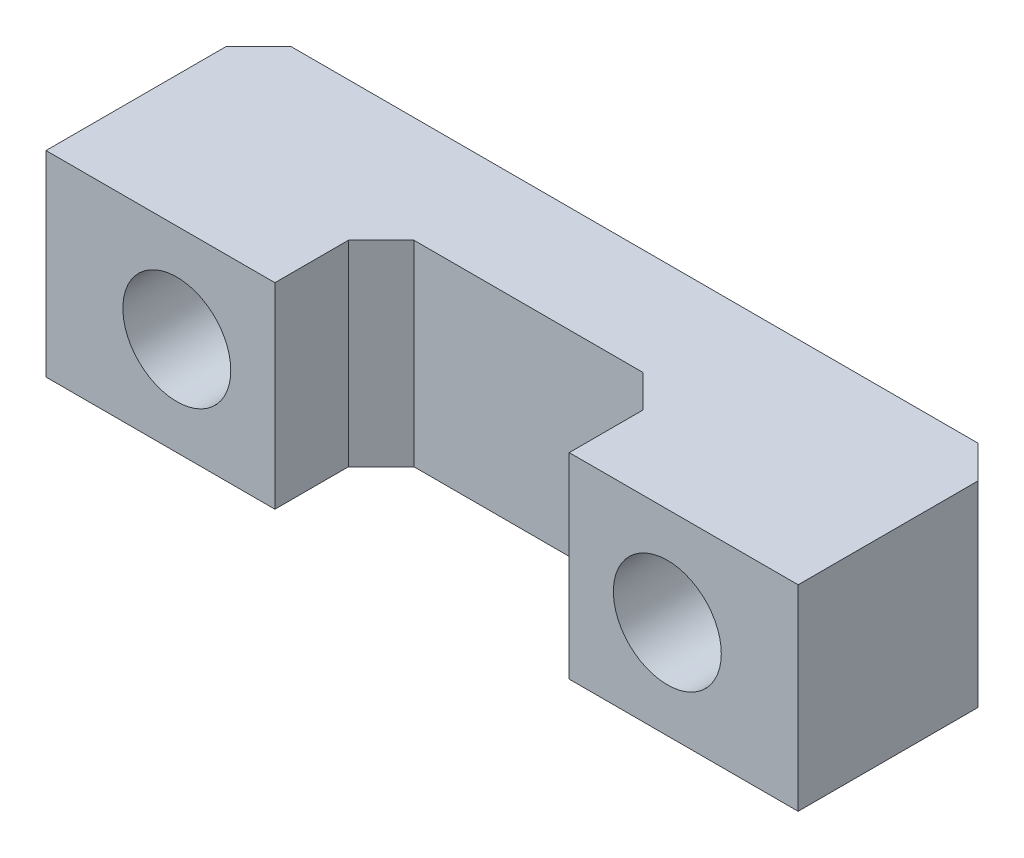
ISO-10303-21;
HEADER;
FILE_DESCRIPTION(('STEP AP214'),'2;1');
FILE_NAME('part.step','',(''),(''),'','','');
FILE_SCHEMA(('AUTOMOTIVE_DESIGN { 1 0 10303 214 1 1 1 1 }'));
ENDSEC;
DATA;
#1=APPLICATION_CONTEXT('core data for automotive mechanical design processes');
#2=APPLICATION_PROTOCOL_DEFINITION('international standard','automotive_design',2000,#1);
#3=PRODUCT_CONTEXT('',#1,'mechanical');
#4=PRODUCT('Part','Part','',(#3));
#5=PRODUCT_RELATED_PRODUCT_CATEGORY('part','',(#4));
#6=PRODUCT_DEFINITION_FORMATION('','',#4);
#7=PRODUCT_DEFINITION_CONTEXT('part definition',#1,'design');
#8=PRODUCT_DEFINITION('design','',#6,#7);
#9=PRODUCT_DEFINITION_SHAPE('','',#8);
#10=(LENGTH_UNIT() NAMED_UNIT(*) SI_UNIT(.MILLI.,.METRE.));
#11=(NAMED_UNIT(*) PLANE_ANGLE_UNIT() SI_UNIT($,.RADIAN.));
#12=(NAMED_UNIT(*) SI_UNIT($,.STERADIAN.) SOLID_ANGLE_UNIT());
#13=UNCERTAINTY_MEASURE_WITH_UNIT(LENGTH_MEASURE(1.E-05),#10,'distance_accuracy_value','');
#14=(GEOMETRIC_REPRESENTATION_CONTEXT(3) GLOBAL_UNCERTAINTY_ASSIGNED_CONTEXT((#13)) GLOBAL_UNIT_ASSIGNED_CONTEXT((#10,
#11,#12)) REPRESENTATION_CONTEXT('',''));
#15=CARTESIAN_POINT('',(0.,0.,0.));
#16=DIRECTION('',(0.,0.,1.));
#17=DIRECTION('',(1.,0.,0.));
#18=AXIS2_PLACEMENT_3D('',#15,#16,#17);
#19=CARTESIAN_POINT('',(4.5,6.,-0.5));
#20=DIRECTION('',(0.,0.,-1.));
#21=DIRECTION('',(-1.,0.,0.));
#22=AXIS2_PLACEMENT_3D('',#19,#20,#21);
#23=PLANE('',#22);
#24=CARTESIAN_POINT('',(7.5,3.,-0.5));
#25=DIRECTION('',(0.,0.,1.));
#26=DIRECTION('',(1.,0.,0.));
#27=AXIS2_PLACEMENT_3D('',#24,#25,#26);
#28=CIRCLE('',#27,1.65);
#29=CARTESIAN_POINT('',(9.15,3.,-0.5));
#30=VERTEX_POINT('',#29);
#31=EDGE_CURVE('E263',#30,#30,#28,.T.);
#32=ORIENTED_EDGE('',*,*,#31,.F.);
#33=EDGE_LOOP('',(#32));
#34=FACE_BOUND('',#33,.T.);
#35=DIRECTION('',(1.,0.,0.));
#36=VECTOR('',#35,1.);
#37=CARTESIAN_POINT('',(4.5,0.,-0.5));
#38=LINE('',#37,#36);
#39=CARTESIAN_POINT('',(4.5,0.,-0.5));
#40=VERTEX_POINT('',#39);
#41=CARTESIAN_POINT('',(11.5,0.,-0.5));
#42=VERTEX_POINT('',#41);
#43=EDGE_CURVE('E155',#40,#42,#38,.T.);
#44=ORIENTED_EDGE('',*,*,#43,.T.);
#45=DIRECTION('',(0.,-1.,0.));
#46=VECTOR('',#45,1.);
#47=CARTESIAN_POINT('',(11.5,6.,-0.5));
#48=LINE('',#47,#46);
#49=CARTESIAN_POINT('',(11.5,6.,-0.5));
#50=VERTEX_POINT('',#49);
#51=EDGE_CURVE('E11',#50,#42,#48,.T.);
#52=ORIENTED_EDGE('',*,*,#51,.F.);
#53=DIRECTION('',(1.,0.,0.));
#54=VECTOR('',#53,1.);
#55=CARTESIAN_POINT('',(4.5,6.,-0.5));
#56=LINE('',#55,#54);
#57=CARTESIAN_POINT('',(4.5,6.,-0.5));
#58=VERTEX_POINT('',#57);
#59=EDGE_CURVE('E177',#58,#50,#56,.T.);
#60=ORIENTED_EDGE('',*,*,#59,.F.);
#61=DIRECTION('',(0.,-1.,0.));
#62=VECTOR('',#61,1.);
#63=CARTESIAN_POINT('',(4.5,6.,-0.5));
#64=LINE('',#63,#62);
#65=EDGE_CURVE('E151',#58,#40,#64,.T.);
#66=ORIENTED_EDGE('',*,*,#65,.T.);
#67=EDGE_LOOP('',(#44,#52,#60,#66));
#68=FACE_BOUND('',#67,.T.);
#69=ADVANCED_FACE('F34',(#34,#68),#23,.F.);
#70=CARTESIAN_POINT('',(11.5,6.,-0.5));
#71=DIRECTION('',(-1.,0.,0.));
#72=DIRECTION('',(0.,0.,1.));
#73=AXIS2_PLACEMENT_3D('',#70,#71,#72);
#74=PLANE('',#73);
#75=DIRECTION('',(0.,0.,-1.));
#76=VECTOR('',#75,1.);
#77=CARTESIAN_POINT('',(11.5,0.,-0.5));
#78=LINE('',#77,#76);
#79=CARTESIAN_POINT('',(11.5,0.,-6.));
#80=VERTEX_POINT('',#79);
#81=EDGE_CURVE('E158',#42,#80,#78,.T.);
#82=ORIENTED_EDGE('',*,*,#81,.T.);
#83=DIRECTION('',(0.,-1.,0.));
#84=VECTOR('',#83,1.);
#85=CARTESIAN_POINT('',(11.5,6.,-6.));
#86=LINE('',#85,#84);
#87=CARTESIAN_POINT('',(11.5,6.,-6.));
#88=VERTEX_POINT('',#87);
#89=EDGE_CURVE('E43',#88,#80,#86,.T.);
#90=ORIENTED_EDGE('',*,*,#89,.F.);
#91=DIRECTION('',(0.,0.,-1.));
#92=VECTOR('',#91,1.);
#93=CARTESIAN_POINT('',(11.5,6.,-0.5));
#94=LINE('',#93,#92);
#95=EDGE_CURVE('E106',#50,#88,#94,.T.);
#96=ORIENTED_EDGE('',*,*,#95,.F.);
#97=ORIENTED_EDGE('',*,*,#51,.T.);
#98=EDGE_LOOP('',(#82,#90,#96,#97));
#99=FACE_BOUND('',#98,.T.);
#100=ADVANCED_FACE('F256',(#99),#74,.F.);
#101=CARTESIAN_POINT('',(11.5,6.,-6.));
#102=DIRECTION('',(-0.707106781186547,0.,0.707106781186548));
#103=DIRECTION('',(0.707106781186548,0.,0.707106781186547));
#104=AXIS2_PLACEMENT_3D('',#101,#102,#103);
#105=PLANE('',#104);
#106=DIRECTION('',(-0.707106781186548,0.,-0.707106781186547));
#107=VECTOR('',#106,1.);
#108=CARTESIAN_POINT('',(11.5,0.,-6.));
#109=LINE('',#108,#107);
#110=CARTESIAN_POINT('',(10.5,0.,-7.));
#111=VERTEX_POINT('',#110);
#112=EDGE_CURVE('E160',#80,#111,#109,.T.);
#113=ORIENTED_EDGE('',*,*,#112,.T.);
#114=DIRECTION('',(0.,-1.,0.));
#115=VECTOR('',#114,1.);
#116=CARTESIAN_POINT('',(10.5,6.,-7.));
#117=LINE('',#116,#115);
#118=CARTESIAN_POINT('',(10.5,6.,-7.));
#119=VERTEX_POINT('',#118);
#120=EDGE_CURVE('E196',#119,#111,#117,.T.);
#121=ORIENTED_EDGE('',*,*,#120,.F.);
#122=DIRECTION('',(-0.707106781186548,0.,-0.707106781186547));
#123=VECTOR('',#122,1.);
#124=CARTESIAN_POINT('',(11.5,6.,-6.));
#125=LINE('',#124,#123);
#126=EDGE_CURVE('E205',#88,#119,#125,.T.);
#127=ORIENTED_EDGE('',*,*,#126,.F.);
#128=ORIENTED_EDGE('',*,*,#89,.T.);
#129=EDGE_LOOP('',(#113,#121,#127,#128));
#130=FACE_BOUND('',#129,.T.);
#131=ADVANCED_FACE('F203',(#130),#105,.F.);
#132=CARTESIAN_POINT('',(10.5,6.,-7.));
#133=DIRECTION('',(0.,0.,1.));
#134=DIRECTION('',(1.,0.,0.));
#135=AXIS2_PLACEMENT_3D('',#132,#133,#134);
#136=PLANE('',#135);
#137=CARTESIAN_POINT('',(-7.5,3.,-7.));
#138=DIRECTION('',(0.,0.,1.));
#139=DIRECTION('',(1.,0.,0.));
#140=AXIS2_PLACEMENT_3D('',#137,#138,#139);
#141=CIRCLE('',#140,1.65);
#142=CARTESIAN_POINT('',(-5.85,3.,-7.));
#143=VERTEX_POINT('',#142);
#144=EDGE_CURVE('E268',#143,#143,#141,.T.);
#145=ORIENTED_EDGE('',*,*,#144,.T.);
#146=EDGE_LOOP('',(#145));
#147=FACE_BOUND('',#146,.T.);
#148=CARTESIAN_POINT('',(7.5,3.,-7.));
#149=DIRECTION('',(0.,0.,1.));
#150=DIRECTION('',(1.,0.,0.));
#151=AXIS2_PLACEMENT_3D('',#148,#149,#150);
#152=CIRCLE('',#151,1.65);
#153=CARTESIAN_POINT('',(9.15,3.,-7.));
#154=VERTEX_POINT('',#153);
#155=EDGE_CURVE('E37',#154,#154,#152,.T.);
#156=ORIENTED_EDGE('',*,*,#155,.T.);
#157=EDGE_LOOP('',(#156));
#158=FACE_BOUND('',#157,.T.);
#159=DIRECTION('',(-1.,0.,0.));
#160=VECTOR('',#159,1.);
#161=CARTESIAN_POINT('',(10.5,0.,-7.));
#162=LINE('',#161,#160);
#163=CARTESIAN_POINT('',(-10.5,0.,-7.));
#164=VERTEX_POINT('',#163);
#165=EDGE_CURVE('E162',#111,#164,#162,.T.);
#166=ORIENTED_EDGE('',*,*,#165,.T.);
#167=DIRECTION('',(0.,-1.,0.));
#168=VECTOR('',#167,1.);
#169=CARTESIAN_POINT('',(-10.5,6.,-7.));
#170=LINE('',#169,#168);
#171=CARTESIAN_POINT('',(-10.5,6.,-7.));
#172=VERTEX_POINT('',#171);
#173=EDGE_CURVE('E193',#172,#164,#170,.T.);
#174=ORIENTED_EDGE('',*,*,#173,.F.);
#175=DIRECTION('',(-1.,0.,0.));
#176=VECTOR('',#175,1.);
#177=CARTESIAN_POINT('',(10.5,6.,-7.));
#178=LINE('',#177,#176);
#179=EDGE_CURVE('E223',#119,#172,#178,.T.);
#180=ORIENTED_EDGE('',*,*,#179,.F.);
#181=ORIENTED_EDGE('',*,*,#120,.T.);
#182=EDGE_LOOP('',(#166,#174,#180,#181));
#183=FACE_BOUND('',#182,.T.);
#184=ADVANCED_FACE('F214',(#147,#158,#183),#136,.F.);
#185=CARTESIAN_POINT('',(-11.5,6.,-6.));
#186=DIRECTION('',(0.707106781186547,0.,0.707106781186548));
#187=DIRECTION('',(0.707106781186548,0.,-0.707106781186547));
#188=AXIS2_PLACEMENT_3D('',#185,#186,#187);
#189=PLANE('',#188);
#190=DIRECTION('',(-0.707106781186548,0.,0.707106781186547));
#191=VECTOR('',#190,1.);
#192=CARTESIAN_POINT('',(-11.5,0.,-6.));
#193=LINE('',#192,#191);
#194=CARTESIAN_POINT('',(-11.5,0.,-6.));
#195=VERTEX_POINT('',#194);
#196=EDGE_CURVE('E164',#164,#195,#193,.T.);
#197=ORIENTED_EDGE('',*,*,#196,.T.);
#198=DIRECTION('',(0.,-1.,0.));
#199=VECTOR('',#198,1.);
#200=CARTESIAN_POINT('',(-11.5,6.,-6.));
#201=LINE('',#200,#199);
#202=CARTESIAN_POINT('',(-11.5,6.,-6.));
#203=VERTEX_POINT('',#202);
#204=EDGE_CURVE('E190',#203,#195,#201,.T.);
#205=ORIENTED_EDGE('',*,*,#204,.F.);
#206=DIRECTION('',(-0.707106781186548,0.,0.707106781186547));
#207=VECTOR('',#206,1.);
#208=CARTESIAN_POINT('',(-11.5,6.,-6.));
#209=LINE('',#208,#207);
#210=EDGE_CURVE('E220',#172,#203,#209,.T.);
#211=ORIENTED_EDGE('',*,*,#210,.F.);
#212=ORIENTED_EDGE('',*,*,#173,.T.);
#213=EDGE_LOOP('',(#197,#205,#211,#212));
#214=FACE_BOUND('',#213,.T.);
#215=ADVANCED_FACE('F218',(#214),#189,.F.);
#216=CARTESIAN_POINT('',(-11.5,6.,-0.5));
#217=DIRECTION('',(1.,0.,0.));
#218=DIRECTION('',(0.,0.,-1.));
#219=AXIS2_PLACEMENT_3D('',#216,#217,#218);
#220=PLANE('',#219);
#221=DIRECTION('',(0.,0.,1.));
#222=VECTOR('',#221,1.);
#223=CARTESIAN_POINT('',(-11.5,0.,-0.5));
#224=LINE('',#223,#222);
#225=CARTESIAN_POINT('',(-11.5,0.,-0.5));
#226=VERTEX_POINT('',#225);
#227=EDGE_CURVE('E166',#195,#226,#224,.T.);
#228=ORIENTED_EDGE('',*,*,#227,.T.);
#229=DIRECTION('',(0.,-1.,0.));
#230=VECTOR('',#229,1.);
#231=CARTESIAN_POINT('',(-11.5,6.,-0.5));
#232=LINE('',#231,#230);
#233=CARTESIAN_POINT('',(-11.5,6.,-0.5));
#234=VERTEX_POINT('',#233);
#235=EDGE_CURVE('E187',#234,#226,#232,.T.);
#236=ORIENTED_EDGE('',*,*,#235,.F.);
#237=DIRECTION('',(0.,0.,1.));
#238=VECTOR('',#237,1.);
#239=CARTESIAN_POINT('',(-11.5,6.,-0.5));
#240=LINE('',#239,#238);
#241=EDGE_CURVE('E222',#203,#234,#240,.T.);
#242=ORIENTED_EDGE('',*,*,#241,.F.);
#243=ORIENTED_EDGE('',*,*,#204,.T.);
#244=EDGE_LOOP('',(#228,#236,#242,#243));
#245=FACE_BOUND('',#244,.T.);
#246=ADVANCED_FACE('F312',(#245),#220,.F.);
#247=CARTESIAN_POINT('',(-11.5,6.,-0.5));
#248=DIRECTION('',(0.,0.,-1.));
#249=DIRECTION('',(-1.,0.,0.));
#250=AXIS2_PLACEMENT_3D('',#247,#248,#249);
#251=PLANE('',#250);
#252=CARTESIAN_POINT('',(-7.5,3.,-0.5));
#253=DIRECTION('',(0.,0.,1.));
#254=DIRECTION('',(1.,0.,0.));
#255=AXIS2_PLACEMENT_3D('',#252,#253,#254);
#256=CIRCLE('',#255,1.65);
#257=CARTESIAN_POINT('',(-5.85,3.,-0.5));
#258=VERTEX_POINT('',#257);
#259=EDGE_CURVE('E265',#258,#258,#256,.T.);
#260=ORIENTED_EDGE('',*,*,#259,.F.);
#261=EDGE_LOOP('',(#260));
#262=FACE_BOUND('',#261,.T.);
#263=DIRECTION('',(1.,0.,0.));
#264=VECTOR('',#263,1.);
#265=CARTESIAN_POINT('',(-11.5,0.,-0.5));
#266=LINE('',#265,#264);
#267=CARTESIAN_POINT('',(-4.5,0.,-0.5));
#268=VERTEX_POINT('',#267);
#269=EDGE_CURVE('E168',#226,#268,#266,.T.);
#270=ORIENTED_EDGE('',*,*,#269,.T.);
#271=DIRECTION('',(0.,-1.,0.));
#272=VECTOR('',#271,1.);
#273=CARTESIAN_POINT('',(-4.5,6.,-0.5));
#274=LINE('',#273,#272);
#275=CARTESIAN_POINT('',(-4.5,6.,-0.5));
#276=VERTEX_POINT('',#275);
#277=EDGE_CURVE('E184',#276,#268,#274,.T.);
#278=ORIENTED_EDGE('',*,*,#277,.F.);
#279=DIRECTION('',(1.,0.,0.));
#280=VECTOR('',#279,1.);
#281=CARTESIAN_POINT('',(-11.5,6.,-0.5));
#282=LINE('',#281,#280);
#283=EDGE_CURVE('E225',#234,#276,#282,.T.);
#284=ORIENTED_EDGE('',*,*,#283,.F.);
#285=ORIENTED_EDGE('',*,*,#235,.T.);
#286=EDGE_LOOP('',(#270,#278,#284,#285));
#287=FACE_BOUND('',#286,.T.);
#288=ADVANCED_FACE('F304',(#262,#287),#251,.F.);
#289=CARTESIAN_POINT('',(-4.5,6.,-2.75));
#290=DIRECTION('',(-1.,0.,0.));
#291=DIRECTION('',(0.,0.,1.));
#292=AXIS2_PLACEMENT_3D('',#289,#290,#291);
#293=PLANE('',#292);
#294=DIRECTION('',(0.,0.,-1.));
#295=VECTOR('',#294,1.);
#296=CARTESIAN_POINT('',(-4.5,0.,-2.75));
#297=LINE('',#296,#295);
#298=CARTESIAN_POINT('',(-4.5,0.,-2.75));
#299=VERTEX_POINT('',#298);
#300=EDGE_CURVE('E170',#268,#299,#297,.T.);
#301=ORIENTED_EDGE('',*,*,#300,.T.);
#302=DIRECTION('',(0.,-1.,0.));
#303=VECTOR('',#302,1.);
#304=CARTESIAN_POINT('',(-4.5,6.,-2.75));
#305=LINE('',#304,#303);
#306=CARTESIAN_POINT('',(-4.5,6.,-2.75));
#307=VERTEX_POINT('',#306);
#308=EDGE_CURVE('E181',#307,#299,#305,.T.);
#309=ORIENTED_EDGE('',*,*,#308,.F.);
#310=DIRECTION('',(0.,0.,-1.));
#311=VECTOR('',#310,1.);
#312=CARTESIAN_POINT('',(-4.5,6.,-2.75));
#313=LINE('',#312,#311);
#314=EDGE_CURVE('E231',#276,#307,#313,.T.);
#315=ORIENTED_EDGE('',*,*,#314,.F.);
#316=ORIENTED_EDGE('',*,*,#277,.T.);
#317=EDGE_LOOP('',(#301,#309,#315,#316));
#318=FACE_BOUND('',#317,.T.);
#319=ADVANCED_FACE('F237',(#318),#293,.F.);
#320=CARTESIAN_POINT('',(-3.49999999999999,6.,-3.75000000000001));
#321=DIRECTION('',(-0.707106781186548,0.,-0.707106781186548));
#322=DIRECTION('',(-0.707106781186548,0.,0.707106781186548));
#323=AXIS2_PLACEMENT_3D('',#320,#321,#322);
#324=PLANE('',#323);
#325=DIRECTION('',(0.707106781186547,0.,-0.707106781186547));
#326=VECTOR('',#325,1.);
#327=CARTESIAN_POINT('',(-3.49999999999999,0.,-3.75000000000001));
#328=LINE('',#327,#326);
#329=CARTESIAN_POINT('',(-3.49999999999999,0.,-3.75000000000001));
#330=VERTEX_POINT('',#329);
#331=EDGE_CURVE('E172',#299,#330,#328,.T.);
#332=ORIENTED_EDGE('',*,*,#331,.T.);
#333=DIRECTION('',(0.,-1.,0.));
#334=VECTOR('',#333,1.);
#335=CARTESIAN_POINT('',(-3.49999999999999,6.,-3.75000000000001));
#336=LINE('',#335,#334);
#337=CARTESIAN_POINT('',(-3.49999999999999,6.,-3.75000000000001));
#338=VERTEX_POINT('',#337);
#339=EDGE_CURVE('E146',#338,#330,#336,.T.);
#340=ORIENTED_EDGE('',*,*,#339,.F.);
#341=DIRECTION('',(0.707106781186547,0.,-0.707106781186547));
#342=VECTOR('',#341,1.);
#343=CARTESIAN_POINT('',(-3.49999999999999,6.,-3.75000000000001));
#344=LINE('',#343,#342);
#345=EDGE_CURVE('E137',#307,#338,#344,.T.);
#346=ORIENTED_EDGE('',*,*,#345,.F.);
#347=ORIENTED_EDGE('',*,*,#308,.T.);
#348=EDGE_LOOP('',(#332,#340,#346,#347));
#349=FACE_BOUND('',#348,.T.);
#350=ADVANCED_FACE('F241',(#349),#324,.F.);
#351=CARTESIAN_POINT('',(3.49999999999999,6.,-3.75000000000001));
#352=DIRECTION('',(0.,0.,-1.));
#353=DIRECTION('',(-1.,0.,0.));
#354=AXIS2_PLACEMENT_3D('',#351,#352,#353);
#355=PLANE('',#354);
#356=DIRECTION('',(1.,0.,0.));
#357=VECTOR('',#356,1.);
#358=CARTESIAN_POINT('',(3.49999999999999,0.,-3.75000000000001));
#359=LINE('',#358,#357);
#360=CARTESIAN_POINT('',(3.49999999999999,0.,-3.75000000000001));
#361=VERTEX_POINT('',#360);
#362=EDGE_CURVE('E145',#330,#361,#359,.T.);
#363=ORIENTED_EDGE('',*,*,#362,.T.);
#364=DIRECTION('',(0.,-1.,0.));
#365=VECTOR('',#364,1.);
#366=CARTESIAN_POINT('',(3.49999999999999,6.,-3.75000000000001));
#367=LINE('',#366,#365);
#368=CARTESIAN_POINT('',(3.49999999999999,6.,-3.75000000000001));
#369=VERTEX_POINT('',#368);
#370=EDGE_CURVE('E142',#369,#361,#367,.T.);
#371=ORIENTED_EDGE('',*,*,#370,.F.);
#372=DIRECTION('',(1.,0.,0.));
#373=VECTOR('',#372,1.);
#374=CARTESIAN_POINT('',(3.49999999999999,6.,-3.75000000000001));
#375=LINE('',#374,#373);
#376=EDGE_CURVE('E131',#338,#369,#375,.T.);
#377=ORIENTED_EDGE('',*,*,#376,.F.);
#378=ORIENTED_EDGE('',*,*,#339,.T.);
#379=EDGE_LOOP('',(#363,#371,#377,#378));
#380=FACE_BOUND('',#379,.T.);
#381=ADVANCED_FACE('F143',(#380),#355,.F.);
#382=CARTESIAN_POINT('',(3.49999999999999,6.,-3.75000000000001));
#383=DIRECTION('',(0.707106781186547,0.,-0.707106781186548));
#384=DIRECTION('',(-0.707106781186548,0.,-0.707106781186547));
#385=AXIS2_PLACEMENT_3D('',#382,#383,#384);
#386=PLANE('',#385);
#387=DIRECTION('',(0.707106781186548,0.,0.707106781186547));
#388=VECTOR('',#387,1.);
#389=CARTESIAN_POINT('',(3.49999999999999,0.,-3.75000000000001));
#390=LINE('',#389,#388);
#391=CARTESIAN_POINT('',(4.49999999999999,0.,-2.75000000000002));
#392=VERTEX_POINT('',#391);
#393=EDGE_CURVE('E92',#361,#392,#390,.T.);
#394=ORIENTED_EDGE('',*,*,#393,.T.);
#395=DIRECTION('',(0.,-1.,0.));
#396=VECTOR('',#395,1.);
#397=CARTESIAN_POINT('',(4.49999999999999,6.,-2.75000000000002));
#398=LINE('',#397,#396);
#399=CARTESIAN_POINT('',(4.49999999999999,6.,-2.75000000000002));
#400=VERTEX_POINT('',#399);
#401=EDGE_CURVE('E147',#400,#392,#398,.T.);
#402=ORIENTED_EDGE('',*,*,#401,.F.);
#403=DIRECTION('',(0.707106781186548,0.,0.707106781186547));
#404=VECTOR('',#403,1.);
#405=CARTESIAN_POINT('',(3.49999999999999,6.,-3.75000000000001));
#406=LINE('',#405,#404);
#407=EDGE_CURVE('E135',#369,#400,#406,.T.);
#408=ORIENTED_EDGE('',*,*,#407,.F.);
#409=ORIENTED_EDGE('',*,*,#370,.T.);
#410=EDGE_LOOP('',(#394,#402,#408,#409));
#411=FACE_BOUND('',#410,.T.);
#412=ADVANCED_FACE('F149',(#411),#386,.F.);
#413=CARTESIAN_POINT('',(4.5,6.,-0.5));
#414=DIRECTION('',(1.,0.,0.));
#415=DIRECTION('',(0.,0.,-1.));
#416=AXIS2_PLACEMENT_3D('',#413,#414,#415);
#417=PLANE('',#416);
#418=DIRECTION('',(0.,0.,1.));
#419=VECTOR('',#418,1.);
#420=CARTESIAN_POINT('',(4.5,0.,-0.5));
#421=LINE('',#420,#419);
#422=EDGE_CURVE('E98',#392,#40,#421,.T.);
#423=ORIENTED_EDGE('',*,*,#422,.T.);
#424=ORIENTED_EDGE('',*,*,#65,.F.);
#425=DIRECTION('',(0.,0.,1.));
#426=VECTOR('',#425,1.);
#427=CARTESIAN_POINT('',(4.5,6.,-0.5));
#428=LINE('',#427,#426);
#429=EDGE_CURVE('E51',#400,#58,#428,.T.);
#430=ORIENTED_EDGE('',*,*,#429,.F.);
#431=ORIENTED_EDGE('',*,*,#401,.T.);
#432=EDGE_LOOP('',(#423,#424,#430,#431));
#433=FACE_BOUND('',#432,.T.);
#434=ADVANCED_FACE('F245',(#433),#417,.F.);
#435=CARTESIAN_POINT('',(0.,6.,0.));
#436=DIRECTION('',(0.,1.,0.));
#437=DIRECTION('',(0.,0.,1.));
#438=AXIS2_PLACEMENT_3D('',#435,#436,#437);
#439=PLANE('',#438);
#440=ORIENTED_EDGE('',*,*,#59,.T.);
#441=ORIENTED_EDGE('',*,*,#95,.T.);
#442=ORIENTED_EDGE('',*,*,#126,.T.);
#443=ORIENTED_EDGE('',*,*,#179,.T.);
#444=ORIENTED_EDGE('',*,*,#210,.T.);
#445=ORIENTED_EDGE('',*,*,#241,.T.);
#446=ORIENTED_EDGE('',*,*,#283,.T.);
#447=ORIENTED_EDGE('',*,*,#314,.T.);
#448=ORIENTED_EDGE('',*,*,#345,.T.);
#449=ORIENTED_EDGE('',*,*,#376,.T.);
#450=ORIENTED_EDGE('',*,*,#407,.T.);
#451=ORIENTED_EDGE('',*,*,#429,.T.);
#452=EDGE_LOOP('',(#440,#441,#442,#443,#444,#445,#446,#447,#448,#449,#450,#451));
#453=FACE_BOUND('',#452,.T.);
#454=ADVANCED_FACE('F133',(#453),#439,.T.);
#455=CARTESIAN_POINT('',(0.,0.,0.));
#456=DIRECTION('',(0.,1.,0.));
#457=DIRECTION('',(0.,0.,1.));
#458=AXIS2_PLACEMENT_3D('',#455,#456,#457);
#459=PLANE('',#458);
#460=ORIENTED_EDGE('',*,*,#43,.F.);
#461=ORIENTED_EDGE('',*,*,#422,.F.);
#462=ORIENTED_EDGE('',*,*,#393,.F.);
#463=ORIENTED_EDGE('',*,*,#362,.F.);
#464=ORIENTED_EDGE('',*,*,#331,.F.);
#465=ORIENTED_EDGE('',*,*,#300,.F.);
#466=ORIENTED_EDGE('',*,*,#269,.F.);
#467=ORIENTED_EDGE('',*,*,#227,.F.);
#468=ORIENTED_EDGE('',*,*,#196,.F.);
#469=ORIENTED_EDGE('',*,*,#165,.F.);
#470=ORIENTED_EDGE('',*,*,#112,.F.);
#471=ORIENTED_EDGE('',*,*,#81,.F.);
#472=EDGE_LOOP('',(#460,#461,#462,#463,#464,#465,#466,#467,#468,#469,#470,#471));
#473=FACE_BOUND('',#472,.T.);
#474=ADVANCED_FACE('F209',(#473),#459,.F.);
#475=CARTESIAN_POINT('',(-7.5,3.,-8.5));
#476=DIRECTION('',(0.,0.,1.));
#477=DIRECTION('',(1.,0.,0.));
#478=AXIS2_PLACEMENT_3D('',#475,#476,#477);
#479=CYLINDRICAL_SURFACE('',#478,1.65);
#480=ORIENTED_EDGE('',*,*,#259,.T.);
#481=EDGE_LOOP('',(#480));
#482=FACE_BOUND('',#481,.T.);
#483=ORIENTED_EDGE('',*,*,#144,.F.);
#484=EDGE_LOOP('',(#483));
#485=FACE_BOUND('',#484,.T.);
#486=ADVANCED_FACE('F282',(#482,#485),#479,.F.);
#487=CARTESIAN_POINT('',(7.5,3.,-8.5));
#488=DIRECTION('',(0.,0.,1.));
#489=DIRECTION('',(1.,0.,0.));
#490=AXIS2_PLACEMENT_3D('',#487,#488,#489);
#491=CYLINDRICAL_SURFACE('',#490,1.65);
#492=ORIENTED_EDGE('',*,*,#31,.T.);
#493=EDGE_LOOP('',(#492));
#494=FACE_BOUND('',#493,.T.);
#495=ORIENTED_EDGE('',*,*,#155,.F.);
#496=EDGE_LOOP('',(#495));
#497=FACE_BOUND('',#496,.T.);
#498=ADVANCED_FACE('F280',(#494,#497),#491,.F.);
#499=CLOSED_SHELL('',(#69,#100,#131,#184,#215,#246,#288,#319,#350,#381,#412,#434,#454,#474,#486,#498));
#500=MANIFOLD_SOLID_BREP('B2',#499);
#501=ADVANCED_BREP_SHAPE_REPRESENTATION('',(#18,#500),#14);
#502=SHAPE_DEFINITION_REPRESENTATION(#9,#501);
ENDSEC;
END-ISO-10303-21;
